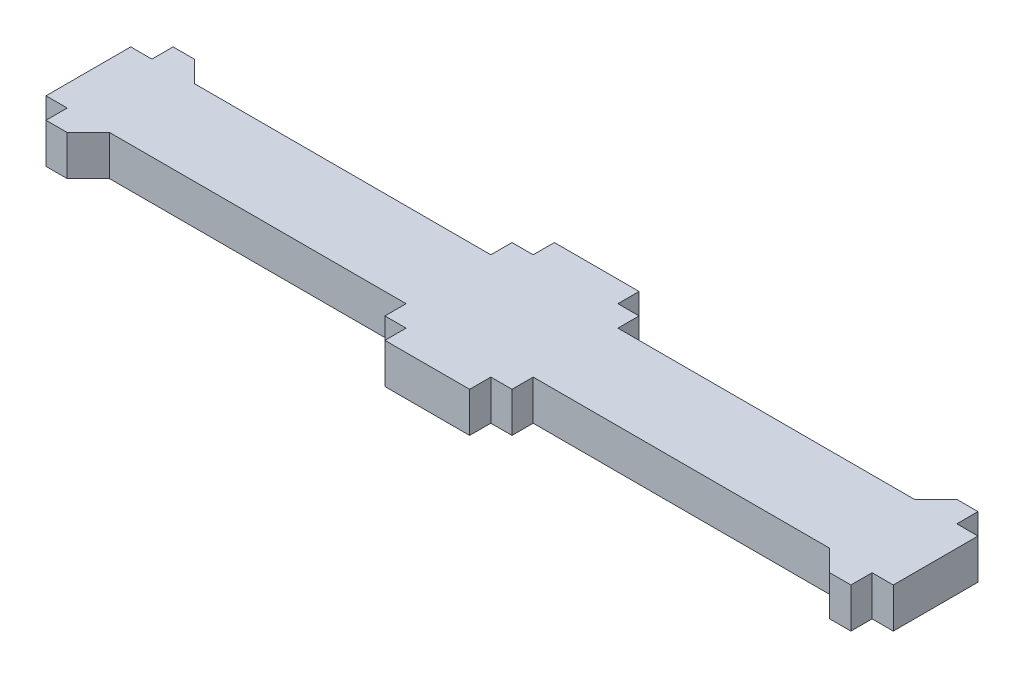
ISO-10303-21;
HEADER;
FILE_DESCRIPTION(('STEP AP214'),'2;1');
FILE_NAME('part.step','',(''),(''),'','','');
FILE_SCHEMA(('AUTOMOTIVE_DESIGN { 1 0 10303 214 1 1 1 1 }'));
ENDSEC;
DATA;
#1=APPLICATION_CONTEXT('core data for automotive mechanical design processes');
#2=APPLICATION_PROTOCOL_DEFINITION('international standard','automotive_design',2000,#1);
#3=PRODUCT_CONTEXT('',#1,'mechanical');
#4=PRODUCT('Part','Part','',(#3));
#5=PRODUCT_RELATED_PRODUCT_CATEGORY('part','',(#4));
#6=PRODUCT_DEFINITION_FORMATION('','',#4);
#7=PRODUCT_DEFINITION_CONTEXT('part definition',#1,'design');
#8=PRODUCT_DEFINITION('design','',#6,#7);
#9=PRODUCT_DEFINITION_SHAPE('','',#8);
#10=(LENGTH_UNIT() NAMED_UNIT(*) SI_UNIT(.MILLI.,.METRE.));
#11=(NAMED_UNIT(*) PLANE_ANGLE_UNIT() SI_UNIT($,.RADIAN.));
#12=(NAMED_UNIT(*) SI_UNIT($,.STERADIAN.) SOLID_ANGLE_UNIT());
#13=UNCERTAINTY_MEASURE_WITH_UNIT(LENGTH_MEASURE(1.E-05),#10,'distance_accuracy_value','');
#14=(GEOMETRIC_REPRESENTATION_CONTEXT(3) GLOBAL_UNCERTAINTY_ASSIGNED_CONTEXT((#13)) GLOBAL_UNIT_ASSIGNED_CONTEXT((#10,
#11,#12)) REPRESENTATION_CONTEXT('',''));
#15=CARTESIAN_POINT('',(0.,0.,0.));
#16=DIRECTION('',(0.,0.,1.));
#17=DIRECTION('',(1.,0.,0.));
#18=AXIS2_PLACEMENT_3D('',#15,#16,#17);
#19=CARTESIAN_POINT('',(0.,5.9944,-19.05));
#20=DIRECTION('',(0.,0.,1.));
#21=DIRECTION('',(1.,0.,0.));
#22=AXIS2_PLACEMENT_3D('',#19,#20,#21);
#23=PLANE('',#22);
#24=DIRECTION('',(-1.,0.,0.));
#25=VECTOR('',#24,1.);
#26=CARTESIAN_POINT('',(0.,0.,-19.05));
#27=LINE('',#26,#25);
#28=CARTESIAN_POINT('',(-57.15,0.,-19.05));
#29=VERTEX_POINT('',#28);
#30=CARTESIAN_POINT('',(-69.85,0.,-19.05));
#31=VERTEX_POINT('',#30);
#32=EDGE_CURVE('E284',#29,#31,#27,.T.);
#33=ORIENTED_EDGE('',*,*,#32,.T.);
#34=DIRECTION('',(0.,-1.,0.));
#35=VECTOR('',#34,1.);
#36=CARTESIAN_POINT('',(-69.85,5.9944,-19.05));
#37=LINE('',#36,#35);
#38=CARTESIAN_POINT('',(-69.85,5.9944,-19.05));
#39=VERTEX_POINT('',#38);
#40=EDGE_CURVE('E282',#39,#31,#37,.T.);
#41=ORIENTED_EDGE('',*,*,#40,.F.);
#42=DIRECTION('',(-1.,0.,0.));
#43=VECTOR('',#42,1.);
#44=CARTESIAN_POINT('',(0.,5.9944,-19.05));
#45=LINE('',#44,#43);
#46=CARTESIAN_POINT('',(-57.15,5.9944,-19.05));
#47=VERTEX_POINT('',#46);
#48=EDGE_CURVE('E268',#47,#39,#45,.T.);
#49=ORIENTED_EDGE('',*,*,#48,.F.);
#50=DIRECTION('',(0.,-1.,0.));
#51=VECTOR('',#50,1.);
#52=CARTESIAN_POINT('',(-57.15,5.9944,-19.05));
#53=LINE('',#52,#51);
#54=EDGE_CURVE('E370',#47,#29,#53,.T.);
#55=ORIENTED_EDGE('',*,*,#54,.T.);
#56=EDGE_LOOP('',(#33,#41,#49,#55));
#57=FACE_BOUND('',#56,.T.);
#58=ADVANCED_FACE('F35',(#57),#23,.F.);
#59=CARTESIAN_POINT('',(-69.85,5.9944,0.));
#60=DIRECTION('',(-1.,0.,0.));
#61=DIRECTION('',(0.,0.,1.));
#62=AXIS2_PLACEMENT_3D('',#59,#60,#61);
#63=PLANE('',#62);
#64=DIRECTION('',(0.,0.,-1.));
#65=VECTOR('',#64,1.);
#66=CARTESIAN_POINT('',(-69.85,0.,0.));
#67=LINE('',#66,#65);
#68=CARTESIAN_POINT('',(-69.85,0.,-15.875));
#69=VERTEX_POINT('',#68);
#70=EDGE_CURVE('E372',#69,#31,#67,.T.);
#71=ORIENTED_EDGE('',*,*,#70,.F.);
#72=DIRECTION('',(0.,-1.,0.));
#73=VECTOR('',#72,1.);
#74=CARTESIAN_POINT('',(-69.85,5.9944,-15.875));
#75=LINE('',#74,#73);
#76=CARTESIAN_POINT('',(-69.85,5.9944,-15.875));
#77=VERTEX_POINT('',#76);
#78=EDGE_CURVE('E289',#77,#69,#75,.T.);
#79=ORIENTED_EDGE('',*,*,#78,.F.);
#80=DIRECTION('',(0.,0.,-1.));
#81=VECTOR('',#80,1.);
#82=CARTESIAN_POINT('',(-69.85,5.9944,0.));
#83=LINE('',#82,#81);
#84=EDGE_CURVE('E272',#77,#39,#83,.T.);
#85=ORIENTED_EDGE('',*,*,#84,.T.);
#86=ORIENTED_EDGE('',*,*,#40,.T.);
#87=EDGE_LOOP('',(#71,#79,#85,#86));
#88=FACE_BOUND('',#87,.T.);
#89=ADVANCED_FACE('F291',(#88),#63,.T.);
#90=CARTESIAN_POINT('',(0.,5.9944,-15.875));
#91=DIRECTION('',(0.,0.,1.));
#92=DIRECTION('',(1.,0.,0.));
#93=AXIS2_PLACEMENT_3D('',#90,#91,#92);
#94=PLANE('',#93);
#95=DIRECTION('',(-1.,0.,0.));
#96=VECTOR('',#95,1.);
#97=CARTESIAN_POINT('',(0.,0.,-15.875));
#98=LINE('',#97,#96);
#99=CARTESIAN_POINT('',(-73.025,0.,-15.875));
#100=VERTEX_POINT('',#99);
#101=EDGE_CURVE('E374',#69,#100,#98,.T.);
#102=ORIENTED_EDGE('',*,*,#101,.T.);
#103=DIRECTION('',(0.,-1.,0.));
#104=VECTOR('',#103,1.);
#105=CARTESIAN_POINT('',(-73.025,5.9944,-15.875));
#106=LINE('',#105,#104);
#107=CARTESIAN_POINT('',(-73.025,5.9944,-15.875));
#108=VERTEX_POINT('',#107);
#109=EDGE_CURVE('E521',#108,#100,#106,.T.);
#110=ORIENTED_EDGE('',*,*,#109,.F.);
#111=DIRECTION('',(-1.,0.,0.));
#112=VECTOR('',#111,1.);
#113=CARTESIAN_POINT('',(0.,5.9944,-15.875));
#114=LINE('',#113,#112);
#115=EDGE_CURVE('E293',#77,#108,#114,.T.);
#116=ORIENTED_EDGE('',*,*,#115,.F.);
#117=ORIENTED_EDGE('',*,*,#78,.T.);
#118=EDGE_LOOP('',(#102,#110,#116,#117));
#119=FACE_BOUND('',#118,.T.);
#120=ADVANCED_FACE('F595',(#119),#94,.F.);
#121=CARTESIAN_POINT('',(-73.025,5.9944,0.));
#122=DIRECTION('',(-1.,0.,0.));
#123=DIRECTION('',(0.,0.,1.));
#124=AXIS2_PLACEMENT_3D('',#121,#122,#123);
#125=PLANE('',#124);
#126=DIRECTION('',(0.,0.,-1.));
#127=VECTOR('',#126,1.);
#128=CARTESIAN_POINT('',(-73.025,0.,0.));
#129=LINE('',#128,#127);
#130=CARTESIAN_POINT('',(-73.025,0.,-12.7));
#131=VERTEX_POINT('',#130);
#132=EDGE_CURVE('E377',#131,#100,#129,.T.);
#133=ORIENTED_EDGE('',*,*,#132,.F.);
#134=DIRECTION('',(0.,-1.,0.));
#135=VECTOR('',#134,1.);
#136=CARTESIAN_POINT('',(-73.025,5.9944,-12.7));
#137=LINE('',#136,#135);
#138=CARTESIAN_POINT('',(-73.025,5.9944,-12.7));
#139=VERTEX_POINT('',#138);
#140=EDGE_CURVE('E519',#139,#131,#137,.T.);
#141=ORIENTED_EDGE('',*,*,#140,.F.);
#142=DIRECTION('',(0.,0.,-1.));
#143=VECTOR('',#142,1.);
#144=CARTESIAN_POINT('',(-73.025,5.9944,0.));
#145=LINE('',#144,#143);
#146=EDGE_CURVE('E295',#139,#108,#145,.T.);
#147=ORIENTED_EDGE('',*,*,#146,.T.);
#148=ORIENTED_EDGE('',*,*,#109,.T.);
#149=EDGE_LOOP('',(#133,#141,#147,#148));
#150=FACE_BOUND('',#149,.T.);
#151=ADVANCED_FACE('F592',(#150),#125,.T.);
#152=CARTESIAN_POINT('',(0.,5.9944,-12.7));
#153=DIRECTION('',(0.,0.,1.));
#154=DIRECTION('',(1.,0.,0.));
#155=AXIS2_PLACEMENT_3D('',#152,#153,#154);
#156=PLANE('',#155);
#157=DIRECTION('',(-1.,0.,0.));
#158=VECTOR('',#157,1.);
#159=CARTESIAN_POINT('',(0.,0.,-12.7));
#160=LINE('',#159,#158);
#161=CARTESIAN_POINT('',(-117.475,0.,-12.7));
#162=VERTEX_POINT('',#161);
#163=EDGE_CURVE('E380',#131,#162,#160,.T.);
#164=ORIENTED_EDGE('',*,*,#163,.T.);
#165=DIRECTION('',(0.,1.,0.));
#166=VECTOR('',#165,1.);
#167=CARTESIAN_POINT('',(-117.475,5.9944,-12.7));
#168=LINE('',#167,#166);
#169=CARTESIAN_POINT('',(-117.475,5.9944,-12.7));
#170=VERTEX_POINT('',#169);
#171=EDGE_CURVE('E50',#162,#170,#168,.T.);
#172=ORIENTED_EDGE('',*,*,#171,.T.);
#173=DIRECTION('',(-1.,0.,0.));
#174=VECTOR('',#173,1.);
#175=CARTESIAN_POINT('',(0.,5.9944,-12.7));
#176=LINE('',#175,#174);
#177=EDGE_CURVE('E300',#139,#170,#176,.T.);
#178=ORIENTED_EDGE('',*,*,#177,.F.);
#179=ORIENTED_EDGE('',*,*,#140,.T.);
#180=EDGE_LOOP('',(#164,#172,#178,#179));
#181=FACE_BOUND('',#180,.T.);
#182=ADVANCED_FACE('F588',(#181),#156,.F.);
#183=CARTESIAN_POINT('',(0.,5.9944,-15.875));
#184=DIRECTION('',(0.,0.,-1.));
#185=DIRECTION('',(-1.,0.,0.));
#186=AXIS2_PLACEMENT_3D('',#183,#184,#185);
#187=PLANE('',#186);
#188=DIRECTION('',(1.,0.,0.));
#189=VECTOR('',#188,1.);
#190=CARTESIAN_POINT('',(0.,0.,-15.875));
#191=LINE('',#190,#189);
#192=CARTESIAN_POINT('',(-123.825,0.,-15.875));
#193=VERTEX_POINT('',#192);
#194=CARTESIAN_POINT('',(-120.65,0.,-15.875));
#195=VERTEX_POINT('',#194);
#196=EDGE_CURVE('E382',#193,#195,#191,.T.);
#197=ORIENTED_EDGE('',*,*,#196,.F.);
#198=DIRECTION('',(0.,-1.,0.));
#199=VECTOR('',#198,1.);
#200=CARTESIAN_POINT('',(-123.825,5.9944,-15.875));
#201=LINE('',#200,#199);
#202=CARTESIAN_POINT('',(-123.825,5.9944,-15.875));
#203=VERTEX_POINT('',#202);
#204=EDGE_CURVE('E514',#203,#193,#201,.T.);
#205=ORIENTED_EDGE('',*,*,#204,.F.);
#206=DIRECTION('',(1.,0.,0.));
#207=VECTOR('',#206,1.);
#208=CARTESIAN_POINT('',(0.,5.9944,-15.875));
#209=LINE('',#208,#207);
#210=CARTESIAN_POINT('',(-120.65,5.9944,-15.875));
#211=VERTEX_POINT('',#210);
#212=EDGE_CURVE('E302',#203,#211,#209,.T.);
#213=ORIENTED_EDGE('',*,*,#212,.T.);
#214=DIRECTION('',(0.,-1.,0.));
#215=VECTOR('',#214,1.);
#216=CARTESIAN_POINT('',(-120.65,5.9944,-15.875));
#217=LINE('',#216,#215);
#218=EDGE_CURVE('E516',#211,#195,#217,.T.);
#219=ORIENTED_EDGE('',*,*,#218,.T.);
#220=EDGE_LOOP('',(#197,#205,#213,#219));
#221=FACE_BOUND('',#220,.T.);
#222=ADVANCED_FACE('F583',(#221),#187,.T.);
#223=CARTESIAN_POINT('',(-123.825,5.9944,0.));
#224=DIRECTION('',(-1.,0.,0.));
#225=DIRECTION('',(0.,0.,1.));
#226=AXIS2_PLACEMENT_3D('',#223,#224,#225);
#227=PLANE('',#226);
#228=DIRECTION('',(0.,0.,-1.));
#229=VECTOR('',#228,1.);
#230=CARTESIAN_POINT('',(-123.825,0.,0.));
#231=LINE('',#230,#229);
#232=CARTESIAN_POINT('',(-123.825,0.,-12.7));
#233=VERTEX_POINT('',#232);
#234=EDGE_CURVE('E384',#233,#193,#231,.T.);
#235=ORIENTED_EDGE('',*,*,#234,.F.);
#236=DIRECTION('',(0.,-1.,0.));
#237=VECTOR('',#236,1.);
#238=CARTESIAN_POINT('',(-123.825,5.9944,-12.7));
#239=LINE('',#238,#237);
#240=CARTESIAN_POINT('',(-123.825,5.9944,-12.7));
#241=VERTEX_POINT('',#240);
#242=EDGE_CURVE('E512',#241,#233,#239,.T.);
#243=ORIENTED_EDGE('',*,*,#242,.F.);
#244=DIRECTION('',(0.,0.,-1.));
#245=VECTOR('',#244,1.);
#246=CARTESIAN_POINT('',(-123.825,5.9944,0.));
#247=LINE('',#246,#245);
#248=EDGE_CURVE('E305',#241,#203,#247,.T.);
#249=ORIENTED_EDGE('',*,*,#248,.T.);
#250=ORIENTED_EDGE('',*,*,#204,.T.);
#251=EDGE_LOOP('',(#235,#243,#249,#250));
#252=FACE_BOUND('',#251,.T.);
#253=ADVANCED_FACE('F577',(#252),#227,.T.);
#254=CARTESIAN_POINT('',(0.,5.9944,-12.7000000000007));
#255=DIRECTION('',(0.,0.,1.));
#256=DIRECTION('',(1.,0.,0.));
#257=AXIS2_PLACEMENT_3D('',#254,#255,#256);
#258=PLANE('',#257);
#259=DIRECTION('',(-1.,0.,0.));
#260=VECTOR('',#259,1.);
#261=CARTESIAN_POINT('',(0.,0.,-12.7000000000007));
#262=LINE('',#261,#260);
#263=CARTESIAN_POINT('',(-127.,0.,-12.7));
#264=VERTEX_POINT('',#263);
#265=EDGE_CURVE('E387',#233,#264,#262,.T.);
#266=ORIENTED_EDGE('',*,*,#265,.T.);
#267=DIRECTION('',(0.,-1.,0.));
#268=VECTOR('',#267,1.);
#269=CARTESIAN_POINT('',(-127.,5.9944,-12.7));
#270=LINE('',#269,#268);
#271=CARTESIAN_POINT('',(-127.,5.9944,-12.7));
#272=VERTEX_POINT('',#271);
#273=EDGE_CURVE('E510',#272,#264,#270,.T.);
#274=ORIENTED_EDGE('',*,*,#273,.F.);
#275=DIRECTION('',(-1.,0.,0.));
#276=VECTOR('',#275,1.);
#277=CARTESIAN_POINT('',(0.,5.9944,-12.7000000000007));
#278=LINE('',#277,#276);
#279=EDGE_CURVE('E308',#241,#272,#278,.T.);
#280=ORIENTED_EDGE('',*,*,#279,.F.);
#281=ORIENTED_EDGE('',*,*,#242,.T.);
#282=EDGE_LOOP('',(#266,#274,#280,#281));
#283=FACE_BOUND('',#282,.T.);
#284=ADVANCED_FACE('F951',(#283),#258,.F.);
#285=CARTESIAN_POINT('',(-127.,5.9944,0.));
#286=DIRECTION('',(-1.,0.,0.));
#287=DIRECTION('',(0.,0.,1.));
#288=AXIS2_PLACEMENT_3D('',#285,#286,#287);
#289=PLANE('',#288);
#290=DIRECTION('',(0.,0.,-1.));
#291=VECTOR('',#290,1.);
#292=CARTESIAN_POINT('',(-127.,0.,0.));
#293=LINE('',#292,#291);
#294=CARTESIAN_POINT('',(-127.,0.,0.));
#295=VERTEX_POINT('',#294);
#296=EDGE_CURVE('E390',#295,#264,#293,.T.);
#297=ORIENTED_EDGE('',*,*,#296,.F.);
#298=DIRECTION('',(0.,-1.,0.));
#299=VECTOR('',#298,1.);
#300=CARTESIAN_POINT('',(-127.,5.9944,0.));
#301=LINE('',#300,#299);
#302=CARTESIAN_POINT('',(-127.,5.9944,0.));
#303=VERTEX_POINT('',#302);
#304=EDGE_CURVE('E508',#303,#295,#301,.T.);
#305=ORIENTED_EDGE('',*,*,#304,.F.);
#306=DIRECTION('',(0.,0.,-1.));
#307=VECTOR('',#306,1.);
#308=CARTESIAN_POINT('',(-127.,5.9944,0.));
#309=LINE('',#308,#307);
#310=EDGE_CURVE('E310',#303,#272,#309,.T.);
#311=ORIENTED_EDGE('',*,*,#310,.T.);
#312=ORIENTED_EDGE('',*,*,#273,.T.);
#313=EDGE_LOOP('',(#297,#305,#311,#312));
#314=FACE_BOUND('',#313,.T.);
#315=ADVANCED_FACE('F571',(#314),#289,.T.);
#316=CARTESIAN_POINT('',(0.,5.9944,6.93889390390723E-13));
#317=DIRECTION('',(0.,0.,1.));
#318=DIRECTION('',(1.,0.,0.));
#319=AXIS2_PLACEMENT_3D('',#316,#317,#318);
#320=PLANE('',#319);
#321=DIRECTION('',(-1.,0.,0.));
#322=VECTOR('',#321,1.);
#323=CARTESIAN_POINT('',(0.,0.,6.93889390390723E-13));
#324=LINE('',#323,#322);
#325=CARTESIAN_POINT('',(-123.825,0.,0.));
#326=VERTEX_POINT('',#325);
#327=EDGE_CURVE('E393',#326,#295,#324,.T.);
#328=ORIENTED_EDGE('',*,*,#327,.F.);
#329=DIRECTION('',(0.,-1.,0.));
#330=VECTOR('',#329,1.);
#331=CARTESIAN_POINT('',(-123.825,5.9944,0.));
#332=LINE('',#331,#330);
#333=CARTESIAN_POINT('',(-123.825,5.9944,0.));
#334=VERTEX_POINT('',#333);
#335=EDGE_CURVE('E506',#334,#326,#332,.T.);
#336=ORIENTED_EDGE('',*,*,#335,.F.);
#337=DIRECTION('',(-1.,0.,0.));
#338=VECTOR('',#337,1.);
#339=CARTESIAN_POINT('',(0.,5.9944,6.93889390390723E-13));
#340=LINE('',#339,#338);
#341=EDGE_CURVE('E313',#334,#303,#340,.T.);
#342=ORIENTED_EDGE('',*,*,#341,.T.);
#343=ORIENTED_EDGE('',*,*,#304,.T.);
#344=EDGE_LOOP('',(#328,#336,#342,#343));
#345=FACE_BOUND('',#344,.T.);
#346=ADVANCED_FACE('F567',(#345),#320,.T.);
#347=CARTESIAN_POINT('',(-123.825,5.9944,0.));
#348=DIRECTION('',(1.,0.,0.));
#349=DIRECTION('',(0.,0.,-1.));
#350=AXIS2_PLACEMENT_3D('',#347,#348,#349);
#351=PLANE('',#350);
#352=DIRECTION('',(0.,0.,1.));
#353=VECTOR('',#352,1.);
#354=CARTESIAN_POINT('',(-123.825,0.,0.));
#355=LINE('',#354,#353);
#356=CARTESIAN_POINT('',(-123.825,0.,3.17500000000001));
#357=VERTEX_POINT('',#356);
#358=EDGE_CURVE('E396',#326,#357,#355,.T.);
#359=ORIENTED_EDGE('',*,*,#358,.T.);
#360=DIRECTION('',(0.,-1.,0.));
#361=VECTOR('',#360,1.);
#362=CARTESIAN_POINT('',(-123.825,5.9944,3.17500000000001));
#363=LINE('',#362,#361);
#364=CARTESIAN_POINT('',(-123.825,5.9944,3.17500000000001));
#365=VERTEX_POINT('',#364);
#366=EDGE_CURVE('E503',#365,#357,#363,.T.);
#367=ORIENTED_EDGE('',*,*,#366,.F.);
#368=DIRECTION('',(0.,0.,1.));
#369=VECTOR('',#368,1.);
#370=CARTESIAN_POINT('',(-123.825,5.9944,0.));
#371=LINE('',#370,#369);
#372=EDGE_CURVE('E316',#334,#365,#371,.T.);
#373=ORIENTED_EDGE('',*,*,#372,.F.);
#374=ORIENTED_EDGE('',*,*,#335,.T.);
#375=EDGE_LOOP('',(#359,#367,#373,#374));
#376=FACE_BOUND('',#375,.T.);
#377=ADVANCED_FACE('F563',(#376),#351,.F.);
#378=CARTESIAN_POINT('',(0.,5.9944,3.17500000000001));
#379=DIRECTION('',(0.,0.,-1.));
#380=DIRECTION('',(-1.,0.,0.));
#381=AXIS2_PLACEMENT_3D('',#378,#379,#380);
#382=PLANE('',#381);
#383=DIRECTION('',(1.,0.,0.));
#384=VECTOR('',#383,1.);
#385=CARTESIAN_POINT('',(0.,0.,3.17500000000001));
#386=LINE('',#385,#384);
#387=CARTESIAN_POINT('',(-120.65,0.,3.17500000000001));
#388=VERTEX_POINT('',#387);
#389=EDGE_CURVE('E398',#357,#388,#386,.T.);
#390=ORIENTED_EDGE('',*,*,#389,.T.);
#391=DIRECTION('',(0.,-1.,0.));
#392=VECTOR('',#391,1.);
#393=CARTESIAN_POINT('',(-120.65,5.9944,3.17500000000001));
#394=LINE('',#393,#392);
#395=CARTESIAN_POINT('',(-120.65,5.9944,3.17500000000001));
#396=VERTEX_POINT('',#395);
#397=EDGE_CURVE('E500',#396,#388,#394,.T.);
#398=ORIENTED_EDGE('',*,*,#397,.F.);
#399=DIRECTION('',(1.,0.,0.));
#400=VECTOR('',#399,1.);
#401=CARTESIAN_POINT('',(0.,5.9944,3.17500000000001));
#402=LINE('',#401,#400);
#403=EDGE_CURVE('E318',#365,#396,#402,.T.);
#404=ORIENTED_EDGE('',*,*,#403,.F.);
#405=ORIENTED_EDGE('',*,*,#366,.T.);
#406=EDGE_LOOP('',(#390,#398,#404,#405));
#407=FACE_BOUND('',#406,.T.);
#408=ADVANCED_FACE('F559',(#407),#382,.F.);
#409=CARTESIAN_POINT('',(0.,5.9944,0.));
#410=DIRECTION('',(0.,0.,1.));
#411=DIRECTION('',(1.,0.,0.));
#412=AXIS2_PLACEMENT_3D('',#409,#410,#411);
#413=PLANE('',#412);
#414=DIRECTION('',(-1.,0.,0.));
#415=VECTOR('',#414,1.);
#416=CARTESIAN_POINT('',(0.,5.9944,0.));
#417=LINE('',#416,#415);
#418=CARTESIAN_POINT('',(-73.025,5.9944,0.));
#419=VERTEX_POINT('',#418);
#420=CARTESIAN_POINT('',(-117.475,5.9944,0.));
#421=VERTEX_POINT('',#420);
#422=EDGE_CURVE('E320',#419,#421,#417,.T.);
#423=ORIENTED_EDGE('',*,*,#422,.T.);
#424=DIRECTION('',(0.,-1.,0.));
#425=VECTOR('',#424,1.);
#426=CARTESIAN_POINT('',(-117.475,0.,0.));
#427=LINE('',#426,#425);
#428=CARTESIAN_POINT('',(-117.475,0.,0.));
#429=VERTEX_POINT('',#428);
#430=EDGE_CURVE('E528',#421,#429,#427,.T.);
#431=ORIENTED_EDGE('',*,*,#430,.T.);
#432=DIRECTION('',(-1.,0.,0.));
#433=VECTOR('',#432,1.);
#434=CARTESIAN_POINT('',(0.,0.,0.));
#435=LINE('',#434,#433);
#436=CARTESIAN_POINT('',(-73.025,0.,0.));
#437=VERTEX_POINT('',#436);
#438=EDGE_CURVE('E401',#437,#429,#435,.T.);
#439=ORIENTED_EDGE('',*,*,#438,.F.);
#440=DIRECTION('',(0.,-1.,0.));
#441=VECTOR('',#440,1.);
#442=CARTESIAN_POINT('',(-73.025,5.9944,0.));
#443=LINE('',#442,#441);
#444=EDGE_CURVE('E498',#419,#437,#443,.T.);
#445=ORIENTED_EDGE('',*,*,#444,.F.);
#446=EDGE_LOOP('',(#423,#431,#439,#445));
#447=FACE_BOUND('',#446,.T.);
#448=ADVANCED_FACE('F550',(#447),#413,.T.);
#449=CARTESIAN_POINT('',(-73.025,5.9944,0.));
#450=DIRECTION('',(1.,0.,0.));
#451=DIRECTION('',(0.,0.,-1.));
#452=AXIS2_PLACEMENT_3D('',#449,#450,#451);
#453=PLANE('',#452);
#454=DIRECTION('',(0.,0.,1.));
#455=VECTOR('',#454,1.);
#456=CARTESIAN_POINT('',(-73.025,0.,0.));
#457=LINE('',#456,#455);
#458=CARTESIAN_POINT('',(-73.025,0.,3.175));
#459=VERTEX_POINT('',#458);
#460=EDGE_CURVE('E404',#437,#459,#457,.T.);
#461=ORIENTED_EDGE('',*,*,#460,.T.);
#462=DIRECTION('',(0.,-1.,0.));
#463=VECTOR('',#462,1.);
#464=CARTESIAN_POINT('',(-73.025,5.9944,3.175));
#465=LINE('',#464,#463);
#466=CARTESIAN_POINT('',(-73.025,5.9944,3.175));
#467=VERTEX_POINT('',#466);
#468=EDGE_CURVE('E496',#467,#459,#465,.T.);
#469=ORIENTED_EDGE('',*,*,#468,.F.);
#470=DIRECTION('',(0.,0.,1.));
#471=VECTOR('',#470,1.);
#472=CARTESIAN_POINT('',(-73.025,5.9944,0.));
#473=LINE('',#472,#471);
#474=EDGE_CURVE('E323',#419,#467,#473,.T.);
#475=ORIENTED_EDGE('',*,*,#474,.F.);
#476=ORIENTED_EDGE('',*,*,#444,.T.);
#477=EDGE_LOOP('',(#461,#469,#475,#476));
#478=FACE_BOUND('',#477,.T.);
#479=ADVANCED_FACE('F680',(#478),#453,.F.);
#480=CARTESIAN_POINT('',(0.,5.9944,3.175));
#481=DIRECTION('',(0.,0.,1.));
#482=DIRECTION('',(1.,0.,0.));
#483=AXIS2_PLACEMENT_3D('',#480,#481,#482);
#484=PLANE('',#483);
#485=DIRECTION('',(-1.,0.,0.));
#486=VECTOR('',#485,1.);
#487=CARTESIAN_POINT('',(0.,0.,3.175));
#488=LINE('',#487,#486);
#489=CARTESIAN_POINT('',(-69.85,0.,3.175));
#490=VERTEX_POINT('',#489);
#491=EDGE_CURVE('E407',#490,#459,#488,.T.);
#492=ORIENTED_EDGE('',*,*,#491,.F.);
#493=DIRECTION('',(0.,-1.,0.));
#494=VECTOR('',#493,1.);
#495=CARTESIAN_POINT('',(-69.85,5.9944,3.175));
#496=LINE('',#495,#494);
#497=CARTESIAN_POINT('',(-69.85,5.9944,3.175));
#498=VERTEX_POINT('',#497);
#499=EDGE_CURVE('E494',#498,#490,#496,.T.);
#500=ORIENTED_EDGE('',*,*,#499,.F.);
#501=DIRECTION('',(-1.,0.,0.));
#502=VECTOR('',#501,1.);
#503=CARTESIAN_POINT('',(0.,5.9944,3.175));
#504=LINE('',#503,#502);
#505=EDGE_CURVE('E325',#498,#467,#504,.T.);
#506=ORIENTED_EDGE('',*,*,#505,.T.);
#507=ORIENTED_EDGE('',*,*,#468,.T.);
#508=EDGE_LOOP('',(#492,#500,#506,#507));
#509=FACE_BOUND('',#508,.T.);
#510=ADVANCED_FACE('F675',(#509),#484,.T.);
#511=CARTESIAN_POINT('',(-69.85,5.9944,0.));
#512=DIRECTION('',(1.,0.,0.));
#513=DIRECTION('',(0.,0.,-1.));
#514=AXIS2_PLACEMENT_3D('',#511,#512,#513);
#515=PLANE('',#514);
#516=DIRECTION('',(0.,0.,1.));
#517=VECTOR('',#516,1.);
#518=CARTESIAN_POINT('',(-69.85,0.,0.));
#519=LINE('',#518,#517);
#520=CARTESIAN_POINT('',(-69.85,0.,6.35));
#521=VERTEX_POINT('',#520);
#522=EDGE_CURVE('E410',#490,#521,#519,.T.);
#523=ORIENTED_EDGE('',*,*,#522,.T.);
#524=DIRECTION('',(0.,-1.,0.));
#525=VECTOR('',#524,1.);
#526=CARTESIAN_POINT('',(-69.85,5.9944,6.35));
#527=LINE('',#526,#525);
#528=CARTESIAN_POINT('',(-69.85,5.9944,6.35));
#529=VERTEX_POINT('',#528);
#530=EDGE_CURVE('E492',#529,#521,#527,.T.);
#531=ORIENTED_EDGE('',*,*,#530,.F.);
#532=DIRECTION('',(0.,0.,1.));
#533=VECTOR('',#532,1.);
#534=CARTESIAN_POINT('',(-69.85,5.9944,0.));
#535=LINE('',#534,#533);
#536=EDGE_CURVE('E328',#498,#529,#535,.T.);
#537=ORIENTED_EDGE('',*,*,#536,.F.);
#538=ORIENTED_EDGE('',*,*,#499,.T.);
#539=EDGE_LOOP('',(#523,#531,#537,#538));
#540=FACE_BOUND('',#539,.T.);
#541=ADVANCED_FACE('F681',(#540),#515,.F.);
#542=CARTESIAN_POINT('',(0.,5.9944,6.35));
#543=DIRECTION('',(0.,0.,1.));
#544=DIRECTION('',(1.,0.,0.));
#545=AXIS2_PLACEMENT_3D('',#542,#543,#544);
#546=PLANE('',#545);
#547=DIRECTION('',(-1.,0.,0.));
#548=VECTOR('',#547,1.);
#549=CARTESIAN_POINT('',(0.,0.,6.35));
#550=LINE('',#549,#548);
#551=CARTESIAN_POINT('',(-57.15,0.,6.35));
#552=VERTEX_POINT('',#551);
#553=EDGE_CURVE('E413',#552,#521,#550,.T.);
#554=ORIENTED_EDGE('',*,*,#553,.F.);
#555=DIRECTION('',(0.,-1.,0.));
#556=VECTOR('',#555,1.);
#557=CARTESIAN_POINT('',(-57.15,5.9944,6.35));
#558=LINE('',#557,#556);
#559=CARTESIAN_POINT('',(-57.15,5.9944,6.35));
#560=VERTEX_POINT('',#559);
#561=EDGE_CURVE('E490',#560,#552,#558,.T.);
#562=ORIENTED_EDGE('',*,*,#561,.F.);
#563=DIRECTION('',(-1.,0.,0.));
#564=VECTOR('',#563,1.);
#565=CARTESIAN_POINT('',(0.,5.9944,6.35));
#566=LINE('',#565,#564);
#567=EDGE_CURVE('E330',#560,#529,#566,.T.);
#568=ORIENTED_EDGE('',*,*,#567,.T.);
#569=ORIENTED_EDGE('',*,*,#530,.T.);
#570=EDGE_LOOP('',(#554,#562,#568,#569));
#571=FACE_BOUND('',#570,.T.);
#572=ADVANCED_FACE('F669',(#571),#546,.T.);
#573=CARTESIAN_POINT('',(-57.15,5.9944,1.2490009027033E-13));
#574=DIRECTION('',(1.,0.,0.));
#575=DIRECTION('',(0.,0.,-1.));
#576=AXIS2_PLACEMENT_3D('',#573,#574,#575);
#577=PLANE('',#576);
#578=DIRECTION('',(0.,0.,1.));
#579=VECTOR('',#578,1.);
#580=CARTESIAN_POINT('',(-57.15,0.,1.2490009027033E-13));
#581=LINE('',#580,#579);
#582=CARTESIAN_POINT('',(-57.15,0.,3.175));
#583=VERTEX_POINT('',#582);
#584=EDGE_CURVE('E416',#583,#552,#581,.T.);
#585=ORIENTED_EDGE('',*,*,#584,.F.);
#586=DIRECTION('',(0.,-1.,0.));
#587=VECTOR('',#586,1.);
#588=CARTESIAN_POINT('',(-57.15,5.9944,3.175));
#589=LINE('',#588,#587);
#590=CARTESIAN_POINT('',(-57.15,5.9944,3.175));
#591=VERTEX_POINT('',#590);
#592=EDGE_CURVE('E488',#591,#583,#589,.T.);
#593=ORIENTED_EDGE('',*,*,#592,.F.);
#594=DIRECTION('',(0.,0.,1.));
#595=VECTOR('',#594,1.);
#596=CARTESIAN_POINT('',(-57.15,5.9944,1.2490009027033E-13));
#597=LINE('',#596,#595);
#598=EDGE_CURVE('E333',#591,#560,#597,.T.);
#599=ORIENTED_EDGE('',*,*,#598,.T.);
#600=ORIENTED_EDGE('',*,*,#561,.T.);
#601=EDGE_LOOP('',(#585,#593,#599,#600));
#602=FACE_BOUND('',#601,.T.);
#603=ADVANCED_FACE('F665',(#602),#577,.T.);
#604=CARTESIAN_POINT('',(0.,5.9944,3.17499999999999));
#605=DIRECTION('',(0.,0.,-1.));
#606=DIRECTION('',(-1.,0.,0.));
#607=AXIS2_PLACEMENT_3D('',#604,#605,#606);
#608=PLANE('',#607);
#609=DIRECTION('',(1.,0.,0.));
#610=VECTOR('',#609,1.);
#611=CARTESIAN_POINT('',(0.,0.,3.17499999999999));
#612=LINE('',#611,#610);
#613=CARTESIAN_POINT('',(-53.975,0.,3.175));
#614=VERTEX_POINT('',#613);
#615=EDGE_CURVE('E419',#583,#614,#612,.T.);
#616=ORIENTED_EDGE('',*,*,#615,.T.);
#617=DIRECTION('',(0.,-1.,0.));
#618=VECTOR('',#617,1.);
#619=CARTESIAN_POINT('',(-53.975,5.9944,3.175));
#620=LINE('',#619,#618);
#621=CARTESIAN_POINT('',(-53.975,5.9944,3.175));
#622=VERTEX_POINT('',#621);
#623=EDGE_CURVE('E486',#622,#614,#620,.T.);
#624=ORIENTED_EDGE('',*,*,#623,.F.);
#625=DIRECTION('',(1.,0.,0.));
#626=VECTOR('',#625,1.);
#627=CARTESIAN_POINT('',(0.,5.9944,3.17499999999999));
#628=LINE('',#627,#626);
#629=EDGE_CURVE('E336',#591,#622,#628,.T.);
#630=ORIENTED_EDGE('',*,*,#629,.F.);
#631=ORIENTED_EDGE('',*,*,#592,.T.);
#632=EDGE_LOOP('',(#616,#624,#630,#631));
#633=FACE_BOUND('',#632,.T.);
#634=ADVANCED_FACE('F889',(#633),#608,.F.);
#635=CARTESIAN_POINT('',(-53.975,5.9944,0.));
#636=DIRECTION('',(1.,0.,0.));
#637=DIRECTION('',(0.,0.,-1.));
#638=AXIS2_PLACEMENT_3D('',#635,#636,#637);
#639=PLANE('',#638);
#640=DIRECTION('',(0.,0.,1.));
#641=VECTOR('',#640,1.);
#642=CARTESIAN_POINT('',(-53.975,0.,0.));
#643=LINE('',#642,#641);
#644=CARTESIAN_POINT('',(-53.975,0.,0.));
#645=VERTEX_POINT('',#644);
#646=EDGE_CURVE('E422',#645,#614,#643,.T.);
#647=ORIENTED_EDGE('',*,*,#646,.F.);
#648=DIRECTION('',(0.,-1.,0.));
#649=VECTOR('',#648,1.);
#650=CARTESIAN_POINT('',(-53.975,5.9944,0.));
#651=LINE('',#650,#649);
#652=CARTESIAN_POINT('',(-53.975,5.9944,0.));
#653=VERTEX_POINT('',#652);
#654=EDGE_CURVE('E484',#653,#645,#651,.T.);
#655=ORIENTED_EDGE('',*,*,#654,.F.);
#656=DIRECTION('',(0.,0.,1.));
#657=VECTOR('',#656,1.);
#658=CARTESIAN_POINT('',(-53.975,5.9944,0.));
#659=LINE('',#658,#657);
#660=EDGE_CURVE('E338',#653,#622,#659,.T.);
#661=ORIENTED_EDGE('',*,*,#660,.T.);
#662=ORIENTED_EDGE('',*,*,#623,.T.);
#663=EDGE_LOOP('',(#647,#655,#661,#662));
#664=FACE_BOUND('',#663,.T.);
#665=ADVANCED_FACE('F660',(#664),#639,.T.);
#666=CARTESIAN_POINT('',(0.,5.9944,0.));
#667=DIRECTION('',(0.,0.,-1.));
#668=DIRECTION('',(-1.,0.,0.));
#669=AXIS2_PLACEMENT_3D('',#666,#667,#668);
#670=PLANE('',#669);
#671=DIRECTION('',(1.,0.,0.));
#672=VECTOR('',#671,1.);
#673=CARTESIAN_POINT('',(0.,0.,0.));
#674=LINE('',#673,#672);
#675=CARTESIAN_POINT('',(-9.52499999999998,0.,0.));
#676=VERTEX_POINT('',#675);
#677=EDGE_CURVE('E425',#645,#676,#674,.T.);
#678=ORIENTED_EDGE('',*,*,#677,.T.);
#679=DIRECTION('',(0.,1.,0.));
#680=VECTOR('',#679,1.);
#681=CARTESIAN_POINT('',(-9.52499999999998,5.9944,0.));
#682=LINE('',#681,#680);
#683=CARTESIAN_POINT('',(-9.52499999999998,5.9944,0.));
#684=VERTEX_POINT('',#683);
#685=EDGE_CURVE('E526',#676,#684,#682,.T.);
#686=ORIENTED_EDGE('',*,*,#685,.T.);
#687=DIRECTION('',(1.,0.,0.));
#688=VECTOR('',#687,1.);
#689=CARTESIAN_POINT('',(0.,5.9944,0.));
#690=LINE('',#689,#688);
#691=EDGE_CURVE('E341',#653,#684,#690,.T.);
#692=ORIENTED_EDGE('',*,*,#691,.F.);
#693=ORIENTED_EDGE('',*,*,#654,.T.);
#694=EDGE_LOOP('',(#678,#686,#692,#693));
#695=FACE_BOUND('',#694,.T.);
#696=ADVANCED_FACE('F651',(#695),#670,.F.);
#697=CARTESIAN_POINT('',(0.,5.9944,3.175));
#698=DIRECTION('',(0.,0.,1.));
#699=DIRECTION('',(1.,0.,0.));
#700=AXIS2_PLACEMENT_3D('',#697,#698,#699);
#701=PLANE('',#700);
#702=DIRECTION('',(-1.,0.,0.));
#703=VECTOR('',#702,1.);
#704=CARTESIAN_POINT('',(0.,0.,3.175));
#705=LINE('',#704,#703);
#706=CARTESIAN_POINT('',(-3.175,0.,3.175));
#707=VERTEX_POINT('',#706);
#708=CARTESIAN_POINT('',(-6.34999999999999,0.,3.175));
#709=VERTEX_POINT('',#708);
#710=EDGE_CURVE('E428',#707,#709,#705,.T.);
#711=ORIENTED_EDGE('',*,*,#710,.F.);
#712=DIRECTION('',(0.,-1.,0.));
#713=VECTOR('',#712,1.);
#714=CARTESIAN_POINT('',(-3.175,5.9944,3.175));
#715=LINE('',#714,#713);
#716=CARTESIAN_POINT('',(-3.175,5.9944,3.175));
#717=VERTEX_POINT('',#716);
#718=EDGE_CURVE('E479',#717,#707,#715,.T.);
#719=ORIENTED_EDGE('',*,*,#718,.F.);
#720=DIRECTION('',(-1.,0.,0.));
#721=VECTOR('',#720,1.);
#722=CARTESIAN_POINT('',(0.,5.9944,3.175));
#723=LINE('',#722,#721);
#724=CARTESIAN_POINT('',(-6.34999999999999,5.9944,3.175));
#725=VERTEX_POINT('',#724);
#726=EDGE_CURVE('E344',#717,#725,#723,.T.);
#727=ORIENTED_EDGE('',*,*,#726,.T.);
#728=DIRECTION('',(0.,-1.,0.));
#729=VECTOR('',#728,1.);
#730=CARTESIAN_POINT('',(-6.34999999999999,5.9944,3.175));
#731=LINE('',#730,#729);
#732=EDGE_CURVE('E481',#725,#709,#731,.T.);
#733=ORIENTED_EDGE('',*,*,#732,.T.);
#734=EDGE_LOOP('',(#711,#719,#727,#733));
#735=FACE_BOUND('',#734,.T.);
#736=ADVANCED_FACE('F644',(#735),#701,.T.);
#737=CARTESIAN_POINT('',(-3.175,5.9944,0.));
#738=DIRECTION('',(1.,0.,0.));
#739=DIRECTION('',(0.,0.,-1.));
#740=AXIS2_PLACEMENT_3D('',#737,#738,#739);
#741=PLANE('',#740);
#742=DIRECTION('',(0.,0.,1.));
#743=VECTOR('',#742,1.);
#744=CARTESIAN_POINT('',(-3.175,0.,0.));
#745=LINE('',#744,#743);
#746=CARTESIAN_POINT('',(-3.175,0.,0.));
#747=VERTEX_POINT('',#746);
#748=EDGE_CURVE('E431',#747,#707,#745,.T.);
#749=ORIENTED_EDGE('',*,*,#748,.F.);
#750=DIRECTION('',(0.,-1.,0.));
#751=VECTOR('',#750,1.);
#752=CARTESIAN_POINT('',(-3.175,5.9944,0.));
#753=LINE('',#752,#751);
#754=CARTESIAN_POINT('',(-3.175,5.9944,0.));
#755=VERTEX_POINT('',#754);
#756=EDGE_CURVE('E477',#755,#747,#753,.T.);
#757=ORIENTED_EDGE('',*,*,#756,.F.);
#758=DIRECTION('',(0.,0.,1.));
#759=VECTOR('',#758,1.);
#760=CARTESIAN_POINT('',(-3.175,5.9944,0.));
#761=LINE('',#760,#759);
#762=EDGE_CURVE('E347',#755,#717,#761,.T.);
#763=ORIENTED_EDGE('',*,*,#762,.T.);
#764=ORIENTED_EDGE('',*,*,#718,.T.);
#765=EDGE_LOOP('',(#749,#757,#763,#764));
#766=FACE_BOUND('',#765,.T.);
#767=ADVANCED_FACE('F638',(#766),#741,.T.);
#768=CARTESIAN_POINT('',(0.,5.9944,0.));
#769=DIRECTION('',(0.,0.,-1.));
#770=DIRECTION('',(-1.,0.,0.));
#771=AXIS2_PLACEMENT_3D('',#768,#769,#770);
#772=PLANE('',#771);
#773=DIRECTION('',(1.,0.,0.));
#774=VECTOR('',#773,1.);
#775=CARTESIAN_POINT('',(0.,0.,0.));
#776=LINE('',#775,#774);
#777=CARTESIAN_POINT('',(0.,0.,0.));
#778=VERTEX_POINT('',#777);
#779=EDGE_CURVE('E434',#747,#778,#776,.T.);
#780=ORIENTED_EDGE('',*,*,#779,.T.);
#781=DIRECTION('',(0.,-1.,0.));
#782=VECTOR('',#781,1.);
#783=CARTESIAN_POINT('',(0.,5.9944,0.));
#784=LINE('',#783,#782);
#785=CARTESIAN_POINT('',(0.,5.9944,0.));
#786=VERTEX_POINT('',#785);
#787=EDGE_CURVE('E474',#786,#778,#784,.T.);
#788=ORIENTED_EDGE('',*,*,#787,.F.);
#789=DIRECTION('',(1.,0.,0.));
#790=VECTOR('',#789,1.);
#791=CARTESIAN_POINT('',(0.,5.9944,0.));
#792=LINE('',#791,#790);
#793=EDGE_CURVE('E350',#755,#786,#792,.T.);
#794=ORIENTED_EDGE('',*,*,#793,.F.);
#795=ORIENTED_EDGE('',*,*,#756,.T.);
#796=EDGE_LOOP('',(#780,#788,#794,#795));
#797=FACE_BOUND('',#796,.T.);
#798=ADVANCED_FACE('F866',(#797),#772,.F.);
#799=CARTESIAN_POINT('',(0.,5.9944,0.));
#800=DIRECTION('',(-1.,0.,0.));
#801=DIRECTION('',(0.,0.,1.));
#802=AXIS2_PLACEMENT_3D('',#799,#800,#801);
#803=PLANE('',#802);
#804=DIRECTION('',(0.,0.,-1.));
#805=VECTOR('',#804,1.);
#806=CARTESIAN_POINT('',(0.,0.,0.));
#807=LINE('',#806,#805);
#808=CARTESIAN_POINT('',(0.,0.,-12.7));
#809=VERTEX_POINT('',#808);
#810=EDGE_CURVE('E436',#778,#809,#807,.T.);
#811=ORIENTED_EDGE('',*,*,#810,.T.);
#812=DIRECTION('',(0.,-1.,0.));
#813=VECTOR('',#812,1.);
#814=CARTESIAN_POINT('',(0.,5.9944,-12.7));
#815=LINE('',#814,#813);
#816=CARTESIAN_POINT('',(0.,5.9944,-12.7));
#817=VERTEX_POINT('',#816);
#818=EDGE_CURVE('E472',#817,#809,#815,.T.);
#819=ORIENTED_EDGE('',*,*,#818,.F.);
#820=DIRECTION('',(0.,0.,-1.));
#821=VECTOR('',#820,1.);
#822=CARTESIAN_POINT('',(0.,5.9944,0.));
#823=LINE('',#822,#821);
#824=EDGE_CURVE('E352',#786,#817,#823,.T.);
#825=ORIENTED_EDGE('',*,*,#824,.F.);
#826=ORIENTED_EDGE('',*,*,#787,.T.);
#827=EDGE_LOOP('',(#811,#819,#825,#826));
#828=FACE_BOUND('',#827,.T.);
#829=ADVANCED_FACE('F632',(#828),#803,.F.);
#830=CARTESIAN_POINT('',(0.,5.9944,-12.7));
#831=DIRECTION('',(0.,0.,-1.));
#832=DIRECTION('',(-1.,0.,0.));
#833=AXIS2_PLACEMENT_3D('',#830,#831,#832);
#834=PLANE('',#833);
#835=DIRECTION('',(1.,0.,0.));
#836=VECTOR('',#835,1.);
#837=CARTESIAN_POINT('',(0.,0.,-12.7));
#838=LINE('',#837,#836);
#839=CARTESIAN_POINT('',(-3.175,0.,-12.7));
#840=VERTEX_POINT('',#839);
#841=EDGE_CURVE('E439',#840,#809,#838,.T.);
#842=ORIENTED_EDGE('',*,*,#841,.F.);
#843=DIRECTION('',(0.,-1.,0.));
#844=VECTOR('',#843,1.);
#845=CARTESIAN_POINT('',(-3.175,5.9944,-12.7));
#846=LINE('',#845,#844);
#847=CARTESIAN_POINT('',(-3.175,5.9944,-12.7));
#848=VERTEX_POINT('',#847);
#849=EDGE_CURVE('E470',#848,#840,#846,.T.);
#850=ORIENTED_EDGE('',*,*,#849,.F.);
#851=DIRECTION('',(1.,0.,0.));
#852=VECTOR('',#851,1.);
#853=CARTESIAN_POINT('',(0.,5.9944,-12.7));
#854=LINE('',#853,#852);
#855=EDGE_CURVE('E354',#848,#817,#854,.T.);
#856=ORIENTED_EDGE('',*,*,#855,.T.);
#857=ORIENTED_EDGE('',*,*,#818,.T.);
#858=EDGE_LOOP('',(#842,#850,#856,#857));
#859=FACE_BOUND('',#858,.T.);
#860=ADVANCED_FACE('F628',(#859),#834,.T.);
#861=CARTESIAN_POINT('',(-3.175,5.9944,0.));
#862=DIRECTION('',(-1.,0.,0.));
#863=DIRECTION('',(0.,0.,1.));
#864=AXIS2_PLACEMENT_3D('',#861,#862,#863);
#865=PLANE('',#864);
#866=DIRECTION('',(0.,0.,-1.));
#867=VECTOR('',#866,1.);
#868=CARTESIAN_POINT('',(-3.175,0.,0.));
#869=LINE('',#868,#867);
#870=CARTESIAN_POINT('',(-3.175,0.,-15.875));
#871=VERTEX_POINT('',#870);
#872=EDGE_CURVE('E442',#840,#871,#869,.T.);
#873=ORIENTED_EDGE('',*,*,#872,.T.);
#874=DIRECTION('',(0.,-1.,0.));
#875=VECTOR('',#874,1.);
#876=CARTESIAN_POINT('',(-3.175,5.9944,-15.875));
#877=LINE('',#876,#875);
#878=CARTESIAN_POINT('',(-3.175,5.9944,-15.875));
#879=VERTEX_POINT('',#878);
#880=EDGE_CURVE('E467',#879,#871,#877,.T.);
#881=ORIENTED_EDGE('',*,*,#880,.F.);
#882=DIRECTION('',(0.,0.,-1.));
#883=VECTOR('',#882,1.);
#884=CARTESIAN_POINT('',(-3.175,5.9944,0.));
#885=LINE('',#884,#883);
#886=EDGE_CURVE('E357',#848,#879,#885,.T.);
#887=ORIENTED_EDGE('',*,*,#886,.F.);
#888=ORIENTED_EDGE('',*,*,#849,.T.);
#889=EDGE_LOOP('',(#873,#881,#887,#888));
#890=FACE_BOUND('',#889,.T.);
#891=ADVANCED_FACE('F623',(#890),#865,.F.);
#892=CARTESIAN_POINT('',(0.,5.9944,-15.875));
#893=DIRECTION('',(0.,0.,1.));
#894=DIRECTION('',(1.,0.,0.));
#895=AXIS2_PLACEMENT_3D('',#892,#893,#894);
#896=PLANE('',#895);
#897=DIRECTION('',(-1.,0.,0.));
#898=VECTOR('',#897,1.);
#899=CARTESIAN_POINT('',(0.,0.,-15.875));
#900=LINE('',#899,#898);
#901=CARTESIAN_POINT('',(-6.34999999999999,0.,-15.875));
#902=VERTEX_POINT('',#901);
#903=EDGE_CURVE('E444',#871,#902,#900,.T.);
#904=ORIENTED_EDGE('',*,*,#903,.T.);
#905=DIRECTION('',(0.,-1.,0.));
#906=VECTOR('',#905,1.);
#907=CARTESIAN_POINT('',(-6.34999999999999,5.9944,-15.875));
#908=LINE('',#907,#906);
#909=CARTESIAN_POINT('',(-6.34999999999999,5.9944,-15.875));
#910=VERTEX_POINT('',#909);
#911=EDGE_CURVE('E464',#910,#902,#908,.T.);
#912=ORIENTED_EDGE('',*,*,#911,.F.);
#913=DIRECTION('',(-1.,0.,0.));
#914=VECTOR('',#913,1.);
#915=CARTESIAN_POINT('',(0.,5.9944,-15.875));
#916=LINE('',#915,#914);
#917=EDGE_CURVE('E359',#879,#910,#916,.T.);
#918=ORIENTED_EDGE('',*,*,#917,.F.);
#919=ORIENTED_EDGE('',*,*,#880,.T.);
#920=EDGE_LOOP('',(#904,#912,#918,#919));
#921=FACE_BOUND('',#920,.T.);
#922=ADVANCED_FACE('F618',(#921),#896,.F.);
#923=CARTESIAN_POINT('',(0.,5.9944,-12.7));
#924=DIRECTION('',(0.,0.,-1.));
#925=DIRECTION('',(-1.,0.,0.));
#926=AXIS2_PLACEMENT_3D('',#923,#924,#925);
#927=PLANE('',#926);
#928=DIRECTION('',(1.,0.,0.));
#929=VECTOR('',#928,1.);
#930=CARTESIAN_POINT('',(0.,5.9944,-12.7));
#931=LINE('',#930,#929);
#932=CARTESIAN_POINT('',(-53.975,5.9944,-12.7));
#933=VERTEX_POINT('',#932);
#934=CARTESIAN_POINT('',(-9.52500000000002,5.9944,-12.7));
#935=VERTEX_POINT('',#934);
#936=EDGE_CURVE('E361',#933,#935,#931,.T.);
#937=ORIENTED_EDGE('',*,*,#936,.T.);
#938=DIRECTION('',(0.,-1.,0.));
#939=VECTOR('',#938,1.);
#940=CARTESIAN_POINT('',(-9.52500000000002,0.,-12.7));
#941=LINE('',#940,#939);
#942=CARTESIAN_POINT('',(-9.52500000000002,0.,-12.7));
#943=VERTEX_POINT('',#942);
#944=EDGE_CURVE('E288',#935,#943,#941,.T.);
#945=ORIENTED_EDGE('',*,*,#944,.T.);
#946=DIRECTION('',(1.,0.,0.));
#947=VECTOR('',#946,1.);
#948=CARTESIAN_POINT('',(0.,0.,-12.7));
#949=LINE('',#948,#947);
#950=CARTESIAN_POINT('',(-53.975,0.,-12.7));
#951=VERTEX_POINT('',#950);
#952=EDGE_CURVE('E447',#951,#943,#949,.T.);
#953=ORIENTED_EDGE('',*,*,#952,.F.);
#954=DIRECTION('',(0.,-1.,0.));
#955=VECTOR('',#954,1.);
#956=CARTESIAN_POINT('',(-53.975,5.9944,-12.7));
#957=LINE('',#956,#955);
#958=EDGE_CURVE('E462',#933,#951,#957,.T.);
#959=ORIENTED_EDGE('',*,*,#958,.F.);
#960=EDGE_LOOP('',(#937,#945,#953,#959));
#961=FACE_BOUND('',#960,.T.);
#962=ADVANCED_FACE('F608',(#961),#927,.T.);
#963=CARTESIAN_POINT('',(-53.975,5.9944,0.));
#964=DIRECTION('',(-1.,0.,0.));
#965=DIRECTION('',(0.,0.,1.));
#966=AXIS2_PLACEMENT_3D('',#963,#964,#965);
#967=PLANE('',#966);
#968=DIRECTION('',(0.,0.,-1.));
#969=VECTOR('',#968,1.);
#970=CARTESIAN_POINT('',(-53.975,0.,0.));
#971=LINE('',#970,#969);
#972=CARTESIAN_POINT('',(-53.975,0.,-15.875));
#973=VERTEX_POINT('',#972);
#974=EDGE_CURVE('E450',#951,#973,#971,.T.);
#975=ORIENTED_EDGE('',*,*,#974,.T.);
#976=DIRECTION('',(0.,-1.,0.));
#977=VECTOR('',#976,1.);
#978=CARTESIAN_POINT('',(-53.975,5.9944,-15.875));
#979=LINE('',#978,#977);
#980=CARTESIAN_POINT('',(-53.975,5.9944,-15.875));
#981=VERTEX_POINT('',#980);
#982=EDGE_CURVE('E460',#981,#973,#979,.T.);
#983=ORIENTED_EDGE('',*,*,#982,.F.);
#984=DIRECTION('',(0.,0.,-1.));
#985=VECTOR('',#984,1.);
#986=CARTESIAN_POINT('',(-53.975,5.9944,0.));
#987=LINE('',#986,#985);
#988=EDGE_CURVE('E364',#933,#981,#987,.T.);
#989=ORIENTED_EDGE('',*,*,#988,.F.);
#990=ORIENTED_EDGE('',*,*,#958,.T.);
#991=EDGE_LOOP('',(#975,#983,#989,#990));
#992=FACE_BOUND('',#991,.T.);
#993=ADVANCED_FACE('F605',(#992),#967,.F.);
#994=CARTESIAN_POINT('',(0.,5.9944,-15.875));
#995=DIRECTION('',(0.,0.,-1.));
#996=DIRECTION('',(-1.,0.,0.));
#997=AXIS2_PLACEMENT_3D('',#994,#995,#996);
#998=PLANE('',#997);
#999=DIRECTION('',(1.,0.,0.));
#1000=VECTOR('',#999,1.);
#1001=CARTESIAN_POINT('',(0.,0.,-15.875));
#1002=LINE('',#1001,#1000);
#1003=CARTESIAN_POINT('',(-57.15,0.,-15.875));
#1004=VERTEX_POINT('',#1003);
#1005=EDGE_CURVE('E453',#1004,#973,#1002,.T.);
#1006=ORIENTED_EDGE('',*,*,#1005,.F.);
#1007=DIRECTION('',(0.,-1.,0.));
#1008=VECTOR('',#1007,1.);
#1009=CARTESIAN_POINT('',(-57.15,5.9944,-15.875));
#1010=LINE('',#1009,#1008);
#1011=CARTESIAN_POINT('',(-57.15,5.9944,-15.875));
#1012=VERTEX_POINT('',#1011);
#1013=EDGE_CURVE('E458',#1012,#1004,#1010,.T.);
#1014=ORIENTED_EDGE('',*,*,#1013,.F.);
#1015=DIRECTION('',(1.,0.,0.));
#1016=VECTOR('',#1015,1.);
#1017=CARTESIAN_POINT('',(0.,5.9944,-15.875));
#1018=LINE('',#1017,#1016);
#1019=EDGE_CURVE('E366',#1012,#981,#1018,.T.);
#1020=ORIENTED_EDGE('',*,*,#1019,.T.);
#1021=ORIENTED_EDGE('',*,*,#982,.T.);
#1022=EDGE_LOOP('',(#1006,#1014,#1020,#1021));
#1023=FACE_BOUND('',#1022,.T.);
#1024=ADVANCED_FACE('F601',(#1023),#998,.T.);
#1025=CARTESIAN_POINT('',(-57.15,5.9944,-1.2490009027033E-13));
#1026=DIRECTION('',(-1.,0.,0.));
#1027=DIRECTION('',(0.,0.,1.));
#1028=AXIS2_PLACEMENT_3D('',#1025,#1026,#1027);
#1029=PLANE('',#1028);
#1030=DIRECTION('',(0.,0.,-1.));
#1031=VECTOR('',#1030,1.);
#1032=CARTESIAN_POINT('',(-57.15,0.,-1.2490009027033E-13));
#1033=LINE('',#1032,#1031);
#1034=EDGE_CURVE('E279',#1004,#29,#1033,.T.);
#1035=ORIENTED_EDGE('',*,*,#1034,.T.);
#1036=ORIENTED_EDGE('',*,*,#54,.F.);
#1037=DIRECTION('',(0.,0.,-1.));
#1038=VECTOR('',#1037,1.);
#1039=CARTESIAN_POINT('',(-57.15,5.9944,-1.2490009027033E-13));
#1040=LINE('',#1039,#1038);
#1041=EDGE_CURVE('E275',#1012,#47,#1040,.T.);
#1042=ORIENTED_EDGE('',*,*,#1041,.F.);
#1043=ORIENTED_EDGE('',*,*,#1013,.T.);
#1044=EDGE_LOOP('',(#1035,#1036,#1042,#1043));
#1045=FACE_BOUND('',#1044,.T.);
#1046=ADVANCED_FACE('F740',(#1045),#1029,.F.);
#1047=CARTESIAN_POINT('',(0.,5.9944,0.));
#1048=DIRECTION('',(0.,1.,0.));
#1049=DIRECTION('',(0.,0.,1.));
#1050=AXIS2_PLACEMENT_3D('',#1047,#1048,#1049);
#1051=PLANE('',#1050);
#1052=ORIENTED_EDGE('',*,*,#48,.T.);
#1053=ORIENTED_EDGE('',*,*,#84,.F.);
#1054=ORIENTED_EDGE('',*,*,#115,.T.);
#1055=ORIENTED_EDGE('',*,*,#146,.F.);
#1056=ORIENTED_EDGE('',*,*,#177,.T.);
#1057=DIRECTION('',(0.707106781186545,0.,0.70710678118655));
#1058=VECTOR('',#1057,1.);
#1059=CARTESIAN_POINT('',(-120.65,5.9944,-15.875));
#1060=LINE('',#1059,#1058);
#1061=EDGE_CURVE('E11',#170,#211,#1060,.F.);
#1062=ORIENTED_EDGE('',*,*,#1061,.T.);
#1063=ORIENTED_EDGE('',*,*,#212,.F.);
#1064=ORIENTED_EDGE('',*,*,#248,.F.);
#1065=ORIENTED_EDGE('',*,*,#279,.T.);
#1066=ORIENTED_EDGE('',*,*,#310,.F.);
#1067=ORIENTED_EDGE('',*,*,#341,.F.);
#1068=ORIENTED_EDGE('',*,*,#372,.T.);
#1069=ORIENTED_EDGE('',*,*,#403,.T.);
#1070=DIRECTION('',(-0.707106781186551,0.,0.707106781186544));
#1071=VECTOR('',#1070,1.);
#1072=CARTESIAN_POINT('',(-117.475,5.9944,0.));
#1073=LINE('',#1072,#1071);
#1074=EDGE_CURVE('E542',#396,#421,#1073,.F.);
#1075=ORIENTED_EDGE('',*,*,#1074,.T.);
#1076=ORIENTED_EDGE('',*,*,#422,.F.);
#1077=ORIENTED_EDGE('',*,*,#474,.T.);
#1078=ORIENTED_EDGE('',*,*,#505,.F.);
#1079=ORIENTED_EDGE('',*,*,#536,.T.);
#1080=ORIENTED_EDGE('',*,*,#567,.F.);
#1081=ORIENTED_EDGE('',*,*,#598,.F.);
#1082=ORIENTED_EDGE('',*,*,#629,.T.);
#1083=ORIENTED_EDGE('',*,*,#660,.F.);
#1084=ORIENTED_EDGE('',*,*,#691,.T.);
#1085=DIRECTION('',(-0.707106781186543,0.,-0.707106781186552));
#1086=VECTOR('',#1085,1.);
#1087=CARTESIAN_POINT('',(-6.34999999999999,5.9944,3.17500000000003));
#1088=LINE('',#1087,#1086);
#1089=EDGE_CURVE('E538',#684,#725,#1088,.F.);
#1090=ORIENTED_EDGE('',*,*,#1089,.T.);
#1091=ORIENTED_EDGE('',*,*,#726,.F.);
#1092=ORIENTED_EDGE('',*,*,#762,.F.);
#1093=ORIENTED_EDGE('',*,*,#793,.T.);
#1094=ORIENTED_EDGE('',*,*,#824,.T.);
#1095=ORIENTED_EDGE('',*,*,#855,.F.);
#1096=ORIENTED_EDGE('',*,*,#886,.T.);
#1097=ORIENTED_EDGE('',*,*,#917,.T.);
#1098=DIRECTION('',(0.707106781186552,0.,-0.707106781186543));
#1099=VECTOR('',#1098,1.);
#1100=CARTESIAN_POINT('',(-9.52500000000002,5.9944,-12.7));
#1101=LINE('',#1100,#1099);
#1102=EDGE_CURVE('E534',#910,#935,#1101,.F.);
#1103=ORIENTED_EDGE('',*,*,#1102,.T.);
#1104=ORIENTED_EDGE('',*,*,#936,.F.);
#1105=ORIENTED_EDGE('',*,*,#988,.T.);
#1106=ORIENTED_EDGE('',*,*,#1019,.F.);
#1107=ORIENTED_EDGE('',*,*,#1041,.T.);
#1108=EDGE_LOOP('',(#1052,#1053,#1054,#1055,#1056,#1062,#1063,#1064,#1065,#1066,#1067,#1068,
#1069,#1075,#1076,#1077,#1078,#1079,#1080,#1081,#1082,#1083,#1084,#1090,#1091,#1092,#1093,#1094,
#1095,#1096,#1097,#1103,#1104,#1105,#1106,#1107));
#1109=FACE_BOUND('',#1108,.T.);
#1110=ADVANCED_FACE('F270',(#1109),#1051,.T.);
#1111=CARTESIAN_POINT('',(0.,0.,0.));
#1112=DIRECTION('',(0.,1.,0.));
#1113=DIRECTION('',(0.,0.,1.));
#1114=AXIS2_PLACEMENT_3D('',#1111,#1112,#1113);
#1115=PLANE('',#1114);
#1116=ORIENTED_EDGE('',*,*,#32,.F.);
#1117=ORIENTED_EDGE('',*,*,#1034,.F.);
#1118=ORIENTED_EDGE('',*,*,#1005,.T.);
#1119=ORIENTED_EDGE('',*,*,#974,.F.);
#1120=ORIENTED_EDGE('',*,*,#952,.T.);
#1121=DIRECTION('',(-0.707106781186552,0.,0.707106781186543));
#1122=VECTOR('',#1121,1.);
#1123=CARTESIAN_POINT('',(-11.1125,0.,-11.1125000000001));
#1124=LINE('',#1123,#1122);
#1125=EDGE_CURVE('E532',#943,#902,#1124,.F.);
#1126=ORIENTED_EDGE('',*,*,#1125,.T.);
#1127=ORIENTED_EDGE('',*,*,#903,.F.);
#1128=ORIENTED_EDGE('',*,*,#872,.F.);
#1129=ORIENTED_EDGE('',*,*,#841,.T.);
#1130=ORIENTED_EDGE('',*,*,#810,.F.);
#1131=ORIENTED_EDGE('',*,*,#779,.F.);
#1132=ORIENTED_EDGE('',*,*,#748,.T.);
#1133=ORIENTED_EDGE('',*,*,#710,.T.);
#1134=DIRECTION('',(0.707106781186543,0.,0.707106781186552));
#1135=VECTOR('',#1134,1.);
#1136=CARTESIAN_POINT('',(-4.76250000000006,0.,4.76249999999999));
#1137=LINE('',#1136,#1135);
#1138=EDGE_CURVE('E536',#709,#676,#1137,.F.);
#1139=ORIENTED_EDGE('',*,*,#1138,.T.);
#1140=ORIENTED_EDGE('',*,*,#677,.F.);
#1141=ORIENTED_EDGE('',*,*,#646,.T.);
#1142=ORIENTED_EDGE('',*,*,#615,.F.);
#1143=ORIENTED_EDGE('',*,*,#584,.T.);
#1144=ORIENTED_EDGE('',*,*,#553,.T.);
#1145=ORIENTED_EDGE('',*,*,#522,.F.);
#1146=ORIENTED_EDGE('',*,*,#491,.T.);
#1147=ORIENTED_EDGE('',*,*,#460,.F.);
#1148=ORIENTED_EDGE('',*,*,#438,.T.);
#1149=DIRECTION('',(0.707106781186551,0.,-0.707106781186544));
#1150=VECTOR('',#1149,1.);
#1151=CARTESIAN_POINT('',(-58.7374999999994,0.,-58.7375));
#1152=LINE('',#1151,#1150);
#1153=EDGE_CURVE('E540',#429,#388,#1152,.F.);
#1154=ORIENTED_EDGE('',*,*,#1153,.T.);
#1155=ORIENTED_EDGE('',*,*,#389,.F.);
#1156=ORIENTED_EDGE('',*,*,#358,.F.);
#1157=ORIENTED_EDGE('',*,*,#327,.T.);
#1158=ORIENTED_EDGE('',*,*,#296,.T.);
#1159=ORIENTED_EDGE('',*,*,#265,.F.);
#1160=ORIENTED_EDGE('',*,*,#234,.T.);
#1161=ORIENTED_EDGE('',*,*,#196,.T.);
#1162=DIRECTION('',(-0.707106781186545,0.,-0.70710678118655));
#1163=VECTOR('',#1162,1.);
#1164=CARTESIAN_POINT('',(-52.3875000000005,0.,52.3875));
#1165=LINE('',#1164,#1163);
#1166=EDGE_CURVE('E43',#195,#162,#1165,.F.);
#1167=ORIENTED_EDGE('',*,*,#1166,.T.);
#1168=ORIENTED_EDGE('',*,*,#163,.F.);
#1169=ORIENTED_EDGE('',*,*,#132,.T.);
#1170=ORIENTED_EDGE('',*,*,#101,.F.);
#1171=ORIENTED_EDGE('',*,*,#70,.T.);
#1172=EDGE_LOOP('',(#1116,#1117,#1118,#1119,#1120,#1126,#1127,#1128,#1129,#1130,#1131,#1132,
#1133,#1139,#1140,#1141,#1142,#1143,#1144,#1145,#1146,#1147,#1148,#1154,#1155,#1156,#1157,#1158,
#1159,#1160,#1161,#1167,#1168,#1169,#1170,#1171));
#1173=FACE_BOUND('',#1172,.T.);
#1174=ADVANCED_FACE('F555',(#1173),#1115,.F.);
#1175=CARTESIAN_POINT('',(-9.52500000000002,5.9944,-12.7));
#1176=DIRECTION('',(-0.707106781186543,0.,-0.707106781186552));
#1177=DIRECTION('',(0.,1.,0.));
#1178=AXIS2_PLACEMENT_3D('',#1175,#1176,#1177);
#1179=PLANE('',#1178);
#1180=ORIENTED_EDGE('',*,*,#1102,.F.);
#1181=ORIENTED_EDGE('',*,*,#911,.T.);
#1182=ORIENTED_EDGE('',*,*,#1125,.F.);
#1183=ORIENTED_EDGE('',*,*,#944,.F.);
#1184=EDGE_LOOP('',(#1180,#1181,#1182,#1183));
#1185=FACE_BOUND('',#1184,.T.);
#1186=ADVANCED_FACE('F613',(#1185),#1179,.T.);
#1187=CARTESIAN_POINT('',(-6.34999999999999,5.9944,3.17500000000003));
#1188=DIRECTION('',(-0.707106781186552,0.,0.707106781186543));
#1189=DIRECTION('',(0.,1.,0.));
#1190=AXIS2_PLACEMENT_3D('',#1187,#1188,#1189);
#1191=PLANE('',#1190);
#1192=ORIENTED_EDGE('',*,*,#1089,.F.);
#1193=ORIENTED_EDGE('',*,*,#685,.F.);
#1194=ORIENTED_EDGE('',*,*,#1138,.F.);
#1195=ORIENTED_EDGE('',*,*,#732,.F.);
#1196=EDGE_LOOP('',(#1192,#1193,#1194,#1195));
#1197=FACE_BOUND('',#1196,.T.);
#1198=ADVANCED_FACE('F654',(#1197),#1191,.T.);
#1199=CARTESIAN_POINT('',(-117.475,5.9944,0.));
#1200=DIRECTION('',(0.707106781186544,0.,0.707106781186551));
#1201=DIRECTION('',(0.,1.,0.));
#1202=AXIS2_PLACEMENT_3D('',#1199,#1200,#1201);
#1203=PLANE('',#1202);
#1204=ORIENTED_EDGE('',*,*,#1074,.F.);
#1205=ORIENTED_EDGE('',*,*,#397,.T.);
#1206=ORIENTED_EDGE('',*,*,#1153,.F.);
#1207=ORIENTED_EDGE('',*,*,#430,.F.);
#1208=EDGE_LOOP('',(#1204,#1205,#1206,#1207));
#1209=FACE_BOUND('',#1208,.T.);
#1210=ADVANCED_FACE('F553',(#1209),#1203,.T.);
#1211=CARTESIAN_POINT('',(-120.65,5.9944,-15.875));
#1212=DIRECTION('',(0.70710678118655,0.,-0.707106781186545));
#1213=DIRECTION('',(0.,1.,0.));
#1214=AXIS2_PLACEMENT_3D('',#1211,#1212,#1213);
#1215=PLANE('',#1214);
#1216=ORIENTED_EDGE('',*,*,#1061,.F.);
#1217=ORIENTED_EDGE('',*,*,#171,.F.);
#1218=ORIENTED_EDGE('',*,*,#1166,.F.);
#1219=ORIENTED_EDGE('',*,*,#218,.F.);
#1220=EDGE_LOOP('',(#1216,#1217,#1218,#1219));
#1221=FACE_BOUND('',#1220,.T.);
#1222=ADVANCED_FACE('F37',(#1221),#1215,.T.);
#1223=CLOSED_SHELL('',(#58,#89,#120,#151,#182,#222,#253,#284,#315,#346,#377,#408,#448,#479,#510,
#541,#572,#603,#634,#665,#696,#736,#767,#798,#829,#860,#891,#922,#962,#993,#1024,#1046,#1110,
#1174,#1186,#1198,#1210,#1222));
#1224=MANIFOLD_SOLID_BREP('B2',#1223);
#1225=ADVANCED_BREP_SHAPE_REPRESENTATION('',(#18,#1224),#14);
#1226=SHAPE_DEFINITION_REPRESENTATION(#9,#1225);
ENDSEC;
END-ISO-10303-21;
